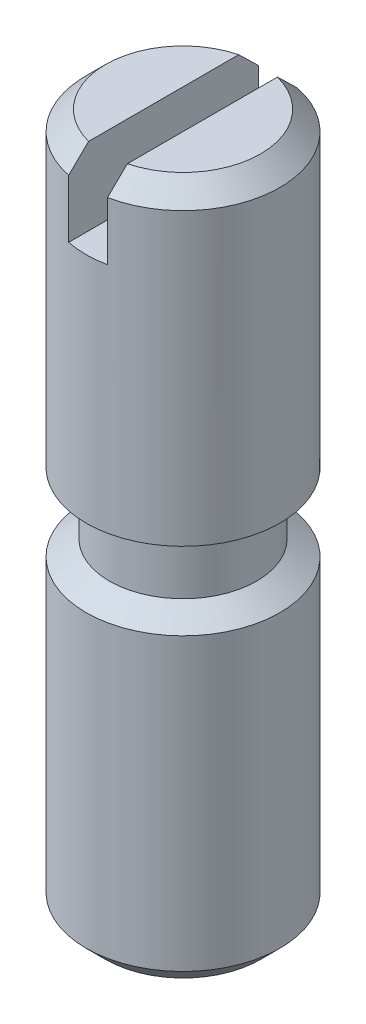
ISO-10303-21;
HEADER;
FILE_DESCRIPTION(('STEP AP214'),'2;1');
FILE_NAME('part.step','',(''),(''),'','','');
FILE_SCHEMA(('AUTOMOTIVE_DESIGN { 1 0 10303 214 1 1 1 1 }'));
ENDSEC;
DATA;
#1=APPLICATION_CONTEXT('core data for automotive mechanical design processes');
#2=APPLICATION_PROTOCOL_DEFINITION('international standard','automotive_design',2000,#1);
#3=PRODUCT_CONTEXT('',#1,'mechanical');
#4=PRODUCT('Part','Part','',(#3));
#5=PRODUCT_RELATED_PRODUCT_CATEGORY('part','',(#4));
#6=PRODUCT_DEFINITION_FORMATION('','',#4);
#7=PRODUCT_DEFINITION_CONTEXT('part definition',#1,'design');
#8=PRODUCT_DEFINITION('design','',#6,#7);
#9=PRODUCT_DEFINITION_SHAPE('','',#8);
#10=(LENGTH_UNIT() NAMED_UNIT(*) SI_UNIT(.MILLI.,.METRE.));
#11=(NAMED_UNIT(*) PLANE_ANGLE_UNIT() SI_UNIT($,.RADIAN.));
#12=(NAMED_UNIT(*) SI_UNIT($,.STERADIAN.) SOLID_ANGLE_UNIT());
#13=UNCERTAINTY_MEASURE_WITH_UNIT(LENGTH_MEASURE(1.E-05),#10,'distance_accuracy_value','');
#14=(GEOMETRIC_REPRESENTATION_CONTEXT(3) GLOBAL_UNCERTAINTY_ASSIGNED_CONTEXT((#13)) GLOBAL_UNIT_ASSIGNED_CONTEXT((#10,
#11,#12)) REPRESENTATION_CONTEXT('',''));
#15=CARTESIAN_POINT('',(0.,0.,0.));
#16=DIRECTION('',(0.,0.,1.));
#17=DIRECTION('',(1.,0.,0.));
#18=AXIS2_PLACEMENT_3D('',#15,#16,#17);
#19=CARTESIAN_POINT('',(0.,18.,0.));
#20=DIRECTION('',(0.,-1.,0.));
#21=DIRECTION('',(0.,0.,-1.));
#22=AXIS2_PLACEMENT_3D('',#19,#20,#21);
#23=CYLINDRICAL_SURFACE('',#22,2.5);
#24=DIRECTION('',(0.,-1.,0.));
#25=VECTOR('',#24,1.);
#26=CARTESIAN_POINT('',(0.5,18.,-2.44948974278318));
#27=LINE('',#26,#25);
#28=CARTESIAN_POINT('',(0.5,16.,-2.44948974278318));
#29=VERTEX_POINT('',#28);
#30=CARTESIAN_POINT('',(0.5,17.5,-2.44948974278318));
#31=VERTEX_POINT('',#30);
#32=EDGE_CURVE('E103',#29,#31,#27,.F.);
#33=ORIENTED_EDGE('',*,*,#32,.T.);
#34=CARTESIAN_POINT('',(0.,17.5,0.));
#35=DIRECTION('',(0.,1.,0.));
#36=DIRECTION('',(0.,0.,1.));
#37=AXIS2_PLACEMENT_3D('',#34,#35,#36);
#38=CIRCLE('',#37,2.5);
#39=CARTESIAN_POINT('',(0.500000000000001,17.5,2.44948974278318));
#40=VERTEX_POINT('',#39);
#41=EDGE_CURVE('E98',#31,#40,#38,.F.);
#42=ORIENTED_EDGE('',*,*,#41,.T.);
#43=DIRECTION('',(0.,-1.,0.));
#44=VECTOR('',#43,1.);
#45=CARTESIAN_POINT('',(0.500000000000001,18.,2.44948974278318));
#46=LINE('',#45,#44);
#47=CARTESIAN_POINT('',(0.500000000000001,16.,2.44948974278318));
#48=VERTEX_POINT('',#47);
#49=EDGE_CURVE('E91',#40,#48,#46,.T.);
#50=ORIENTED_EDGE('',*,*,#49,.T.);
#51=CARTESIAN_POINT('',(0.,16.,0.));
#52=DIRECTION('',(0.,1.,0.));
#53=DIRECTION('',(0.,0.,1.));
#54=AXIS2_PLACEMENT_3D('',#51,#52,#53);
#55=CIRCLE('',#54,2.5);
#56=CARTESIAN_POINT('',(-0.499999999999999,16.,2.44948974278318));
#57=VERTEX_POINT('',#56);
#58=EDGE_CURVE('E96',#57,#48,#55,.T.);
#59=ORIENTED_EDGE('',*,*,#58,.F.);
#60=DIRECTION('',(0.,-1.,0.));
#61=VECTOR('',#60,1.);
#62=CARTESIAN_POINT('',(-0.499999999999999,18.,2.44948974278318));
#63=LINE('',#62,#61);
#64=CARTESIAN_POINT('',(-0.499999999999999,17.5,2.44948974278318));
#65=VERTEX_POINT('',#64);
#66=EDGE_CURVE('E102',#57,#65,#63,.F.);
#67=ORIENTED_EDGE('',*,*,#66,.T.);
#68=CARTESIAN_POINT('',(0.,17.5,0.));
#69=DIRECTION('',(0.,1.,0.));
#70=DIRECTION('',(0.,0.,1.));
#71=AXIS2_PLACEMENT_3D('',#68,#69,#70);
#72=CIRCLE('',#71,2.5);
#73=CARTESIAN_POINT('',(-0.5,17.5,-2.44948974278318));
#74=VERTEX_POINT('',#73);
#75=EDGE_CURVE('E234',#65,#74,#72,.F.);
#76=ORIENTED_EDGE('',*,*,#75,.T.);
#77=DIRECTION('',(0.,-1.,0.));
#78=VECTOR('',#77,1.);
#79=CARTESIAN_POINT('',(-0.5,18.,-2.44948974278318));
#80=LINE('',#79,#78);
#81=CARTESIAN_POINT('',(-0.5,16.,-2.44948974278318));
#82=VERTEX_POINT('',#81);
#83=EDGE_CURVE('E126',#74,#82,#80,.T.);
#84=ORIENTED_EDGE('',*,*,#83,.T.);
#85=EDGE_CURVE('E114',#29,#82,#55,.T.);
#86=ORIENTED_EDGE('',*,*,#85,.F.);
#87=EDGE_LOOP('',(#33,#42,#50,#59,#67,#76,#84,#86));
#88=FACE_BOUND('',#87,.T.);
#89=CARTESIAN_POINT('',(0.,10.,0.));
#90=DIRECTION('',(0.,1.,0.));
#91=DIRECTION('',(0.,0.,1.));
#92=AXIS2_PLACEMENT_3D('',#89,#90,#91);
#93=CIRCLE('',#92,2.5);
#94=CARTESIAN_POINT('',(0.,10.,2.5));
#95=VERTEX_POINT('',#94);
#96=EDGE_CURVE('E121',#95,#95,#93,.T.);
#97=ORIENTED_EDGE('',*,*,#96,.T.);
#98=EDGE_LOOP('',(#97));
#99=FACE_BOUND('',#98,.T.);
#100=ADVANCED_FACE('F36',(#88,#99),#23,.T.);
#101=CARTESIAN_POINT('',(0.,18.,0.));
#102=DIRECTION('',(0.,1.,0.));
#103=DIRECTION('',(0.,0.,1.));
#104=AXIS2_PLACEMENT_3D('',#101,#102,#103);
#105=PLANE('',#104);
#106=DIRECTION('',(0.,0.,1.));
#107=VECTOR('',#106,1.);
#108=CARTESIAN_POINT('',(-0.5,18.,0.));
#109=LINE('',#108,#107);
#110=CARTESIAN_POINT('',(-0.5,18.,-1.9364916731037));
#111=VERTEX_POINT('',#110);
#112=CARTESIAN_POINT('',(-0.499999999999999,18.,1.9364916731037));
#113=VERTEX_POINT('',#112);
#114=EDGE_CURVE('E115',#111,#113,#109,.T.);
#115=ORIENTED_EDGE('',*,*,#114,.F.);
#116=CARTESIAN_POINT('',(0.,18.,0.));
#117=DIRECTION('',(0.,1.,0.));
#118=DIRECTION('',(0.,0.,1.));
#119=AXIS2_PLACEMENT_3D('',#116,#117,#118);
#120=CIRCLE('',#119,2.);
#121=EDGE_CURVE('E237',#111,#113,#120,.T.);
#122=ORIENTED_EDGE('',*,*,#121,.T.);
#123=EDGE_LOOP('',(#115,#122));
#124=FACE_BOUND('',#123,.T.);
#125=ADVANCED_FACE('F183',(#124),#105,.T.);
#126=DIRECTION('',(0.,0.,-1.));
#127=VECTOR('',#126,1.);
#128=CARTESIAN_POINT('',(0.5,18.,0.));
#129=LINE('',#128,#127);
#130=CARTESIAN_POINT('',(0.500000000000001,18.,1.9364916731037));
#131=VERTEX_POINT('',#130);
#132=CARTESIAN_POINT('',(0.5,18.,-1.9364916731037));
#133=VERTEX_POINT('',#132);
#134=EDGE_CURVE('E128',#131,#133,#129,.T.);
#135=ORIENTED_EDGE('',*,*,#134,.F.);
#136=CARTESIAN_POINT('',(0.,18.,0.));
#137=DIRECTION('',(0.,1.,0.));
#138=DIRECTION('',(0.,0.,1.));
#139=AXIS2_PLACEMENT_3D('',#136,#137,#138);
#140=CIRCLE('',#139,2.);
#141=EDGE_CURVE('E131',#131,#133,#140,.T.);
#142=ORIENTED_EDGE('',*,*,#141,.T.);
#143=EDGE_LOOP('',(#135,#142));
#144=FACE_BOUND('',#143,.T.);
#145=ADVANCED_FACE('F159',(#144),#105,.T.);
#146=CARTESIAN_POINT('',(-0.499999999999999,16.,4.94695527819999));
#147=DIRECTION('',(0.,1.,0.));
#148=DIRECTION('',(0.,0.,1.));
#149=AXIS2_PLACEMENT_3D('',#146,#147,#148);
#150=PLANE('',#149);
#151=ORIENTED_EDGE('',*,*,#85,.T.);
#152=DIRECTION('',(0.,0.,1.));
#153=VECTOR('',#152,1.);
#154=CARTESIAN_POINT('',(-0.5,16.,-3.80448227912211));
#155=LINE('',#154,#153);
#156=EDGE_CURVE('E113',#82,#57,#155,.T.);
#157=ORIENTED_EDGE('',*,*,#156,.T.);
#158=ORIENTED_EDGE('',*,*,#58,.T.);
#159=DIRECTION('',(0.,0.,-1.));
#160=VECTOR('',#159,1.);
#161=CARTESIAN_POINT('',(0.5,16.,-3.80448227912211));
#162=LINE('',#161,#160);
#163=EDGE_CURVE('E110',#48,#29,#162,.T.);
#164=ORIENTED_EDGE('',*,*,#163,.T.);
#165=EDGE_LOOP('',(#151,#157,#158,#164));
#166=FACE_BOUND('',#165,.T.);
#167=ADVANCED_FACE('F109',(#166),#150,.T.);
#168=CARTESIAN_POINT('',(-0.5,16.,-3.80448227912211));
#169=DIRECTION('',(-1.,0.,0.));
#170=DIRECTION('',(0.,0.,1.));
#171=AXIS2_PLACEMENT_3D('',#168,#169,#170);
#172=PLANE('',#171);
#173=ORIENTED_EDGE('',*,*,#114,.T.);
#174=CARTESIAN_POINT('',(-0.499999999999999,18.,1.9364916731037));
#175=CARTESIAN_POINT('',(-0.499999999999999,17.9584739891285,1.97937842021901));
#176=CARTESIAN_POINT('',(-0.499999999999999,17.9169046578955,2.02222317422963));
#177=CARTESIAN_POINT('',(-0.499999999999999,17.8336921234945,2.10784071321671));
#178=CARTESIAN_POINT('',(-0.499999999999999,17.7920489204858,2.1506134983479));
#179=CARTESIAN_POINT('',(-0.499999999999999,17.7087012598324,2.23609927318237));
#180=CARTESIAN_POINT('',(-0.499999999999999,17.6669968022281,2.27881226292497));
#181=CARTESIAN_POINT('',(-0.499999999999999,17.5835354615012,2.36418717471362));
#182=CARTESIAN_POINT('',(-0.499999999999999,17.5417785782661,2.40684909664984));
#183=CARTESIAN_POINT('',(-0.499999999999999,17.5,2.44948974278318));
#184=B_SPLINE_CURVE_WITH_KNOTS('',3,(#174,#175,#176,#177,#178,#179,#180,#181,#182,#183),
.UNSPECIFIED.,.F.,.F.,(4,2,2,2,4),(0.,0.179089685770155,0.358178986005779,0.537268168449539,
0.716357735365869),.UNSPECIFIED.);
#185=EDGE_CURVE('E44',#113,#65,#184,.T.);
#186=ORIENTED_EDGE('',*,*,#185,.T.);
#187=ORIENTED_EDGE('',*,*,#66,.F.);
#188=ORIENTED_EDGE('',*,*,#156,.F.);
#189=ORIENTED_EDGE('',*,*,#83,.F.);
#190=CARTESIAN_POINT('',(-0.5,17.5,-2.44948974278318));
#191=CARTESIAN_POINT('',(-0.5,17.5417785782661,-2.40684909664984));
#192=CARTESIAN_POINT('',(-0.5,17.5835354615012,-2.36418717471362));
#193=CARTESIAN_POINT('',(-0.5,17.6669968022281,-2.27881226292497));
#194=CARTESIAN_POINT('',(-0.5,17.7087012598324,-2.23609927318237));
#195=CARTESIAN_POINT('',(-0.5,17.7920489204858,-2.1506134983479));
#196=CARTESIAN_POINT('',(-0.5,17.8336921234945,-2.10784071321671));
#197=CARTESIAN_POINT('',(-0.5,17.9169046578955,-2.02222317422964));
#198=CARTESIAN_POINT('',(-0.5,17.9584739891285,-1.97937842021901));
#199=CARTESIAN_POINT('',(-0.5,18.,-1.93649167310371));
#200=B_SPLINE_CURVE_WITH_KNOTS('',3,(#190,#191,#192,#193,#194,#195,#196,#197,#198,#199),
.UNSPECIFIED.,.F.,.F.,(4,2,2,2,4),(0.,0.179089566916328,0.358178749360088,0.537268049595715,
0.716357735365869),.UNSPECIFIED.);
#201=EDGE_CURVE('E58',#74,#111,#200,.T.);
#202=ORIENTED_EDGE('',*,*,#201,.T.);
#203=EDGE_LOOP('',(#173,#186,#187,#188,#189,#202));
#204=FACE_BOUND('',#203,.T.);
#205=ADVANCED_FACE('F153',(#204),#172,.F.);
#206=CARTESIAN_POINT('',(0.5,16.,-3.80448227912211));
#207=DIRECTION('',(1.,0.,0.));
#208=DIRECTION('',(0.,0.,-1.));
#209=AXIS2_PLACEMENT_3D('',#206,#207,#208);
#210=PLANE('',#209);
#211=ORIENTED_EDGE('',*,*,#134,.T.);
#212=CARTESIAN_POINT('',(0.5,18.,-1.9364916731037));
#213=CARTESIAN_POINT('',(0.5,17.9584739891285,-1.97937842021901));
#214=CARTESIAN_POINT('',(0.5,17.9169046578955,-2.02222317422963));
#215=CARTESIAN_POINT('',(0.5,17.8336921234945,-2.10784071321671));
#216=CARTESIAN_POINT('',(0.5,17.7920489204858,-2.1506134983479));
#217=CARTESIAN_POINT('',(0.5,17.7087012598324,-2.23609927318237));
#218=CARTESIAN_POINT('',(0.5,17.6669968022281,-2.27881226292498));
#219=CARTESIAN_POINT('',(0.5,17.5835354615012,-2.36418717471362));
#220=CARTESIAN_POINT('',(0.5,17.5417785782661,-2.40684909664984));
#221=CARTESIAN_POINT('',(0.5,17.5,-2.44948974278318));
#222=B_SPLINE_CURVE_WITH_KNOTS('',3,(#212,#213,#214,#215,#216,#217,#218,#219,#220,#221),
.UNSPECIFIED.,.F.,.F.,(4,2,2,2,4),(0.,0.179089685770155,0.35817898600578,0.537268168449543,
0.71635773536587),.UNSPECIFIED.);
#223=EDGE_CURVE('E141',#133,#31,#222,.T.);
#224=ORIENTED_EDGE('',*,*,#223,.T.);
#225=ORIENTED_EDGE('',*,*,#32,.F.);
#226=ORIENTED_EDGE('',*,*,#163,.F.);
#227=ORIENTED_EDGE('',*,*,#49,.F.);
#228=CARTESIAN_POINT('',(0.500000000000001,17.5,2.44948974278318));
#229=CARTESIAN_POINT('',(0.500000000000001,17.5417785782661,2.40684909664984));
#230=CARTESIAN_POINT('',(0.500000000000001,17.5835354615012,2.36418717471362));
#231=CARTESIAN_POINT('',(0.500000000000001,17.6669968022281,2.27881226292497));
#232=CARTESIAN_POINT('',(0.500000000000001,17.7087012598324,2.23609927318237));
#233=CARTESIAN_POINT('',(0.500000000000001,17.7920489204858,2.1506134983479));
#234=CARTESIAN_POINT('',(0.500000000000001,17.8336921234945,2.10784071321671));
#235=CARTESIAN_POINT('',(0.500000000000001,17.9169046578955,2.02222317422963));
#236=CARTESIAN_POINT('',(0.500000000000001,17.9584739891285,1.97937842021901));
#237=CARTESIAN_POINT('',(0.500000000000001,18.,1.9364916731037));
#238=B_SPLINE_CURVE_WITH_KNOTS('',3,(#228,#229,#230,#231,#232,#233,#234,#235,#236,#237),
.UNSPECIFIED.,.F.,.F.,(4,2,2,2,4),(0.,0.179089566916331,0.35817874936009,0.537268049595715,
0.71635773536587),.UNSPECIFIED.);
#239=EDGE_CURVE('E134',#40,#131,#238,.T.);
#240=ORIENTED_EDGE('',*,*,#239,.T.);
#241=EDGE_LOOP('',(#211,#224,#225,#226,#227,#240));
#242=FACE_BOUND('',#241,.T.);
#243=ADVANCED_FACE('F118',(#242),#210,.F.);
#244=CARTESIAN_POINT('',(0.,18.,0.));
#245=DIRECTION('',(0.,-1.,0.));
#246=DIRECTION('',(0.,0.,-1.));
#247=AXIS2_PLACEMENT_3D('',#244,#245,#246);
#248=CONICAL_SURFACE('',#247,2.,0.785398163397448);
#249=ORIENTED_EDGE('',*,*,#239,.F.);
#250=ORIENTED_EDGE('',*,*,#41,.F.);
#251=ORIENTED_EDGE('',*,*,#223,.F.);
#252=ORIENTED_EDGE('',*,*,#141,.F.);
#253=EDGE_LOOP('',(#249,#250,#251,#252));
#254=FACE_BOUND('',#253,.T.);
#255=ADVANCED_FACE('F146',(#254),#248,.T.);
#256=CARTESIAN_POINT('',(0.,18.,0.));
#257=DIRECTION('',(0.,-1.,0.));
#258=DIRECTION('',(0.,0.,-1.));
#259=AXIS2_PLACEMENT_3D('',#256,#257,#258);
#260=CONICAL_SURFACE('',#259,2.,0.785398163397448);
#261=ORIENTED_EDGE('',*,*,#201,.F.);
#262=ORIENTED_EDGE('',*,*,#75,.F.);
#263=ORIENTED_EDGE('',*,*,#185,.F.);
#264=ORIENTED_EDGE('',*,*,#121,.F.);
#265=EDGE_LOOP('',(#261,#262,#263,#264));
#266=FACE_BOUND('',#265,.T.);
#267=ADVANCED_FACE('F170',(#266),#260,.T.);
#268=CARTESIAN_POINT('',(2.5,10.,0.));
#269=DIRECTION('',(0.,-1.,0.));
#270=DIRECTION('',(0.,0.,-1.));
#271=AXIS2_PLACEMENT_3D('',#268,#269,#270);
#272=PLANE('',#271);
#273=CARTESIAN_POINT('',(0.,10.,0.));
#274=DIRECTION('',(0.,1.,0.));
#275=DIRECTION('',(0.,0.,1.));
#276=AXIS2_PLACEMENT_3D('',#273,#274,#275);
#277=CIRCLE('',#276,1.9);
#278=CARTESIAN_POINT('',(0.,10.,1.9));
#279=VERTEX_POINT('',#278);
#280=EDGE_CURVE('E207',#279,#279,#277,.T.);
#281=ORIENTED_EDGE('',*,*,#280,.T.);
#282=EDGE_LOOP('',(#281));
#283=FACE_BOUND('',#282,.T.);
#284=ORIENTED_EDGE('',*,*,#96,.F.);
#285=EDGE_LOOP('',(#284));
#286=FACE_BOUND('',#285,.T.);
#287=ADVANCED_FACE('F173',(#283,#286),#272,.T.);
#288=CARTESIAN_POINT('',(0.,12.2324832688002,0.));
#289=DIRECTION('',(0.,1.,0.));
#290=DIRECTION('',(0.,0.,1.));
#291=AXIS2_PLACEMENT_3D('',#288,#289,#290);
#292=CYLINDRICAL_SURFACE('',#291,1.9);
#293=CARTESIAN_POINT('',(0.,8.40442113513973,0.));
#294=DIRECTION('',(0.,1.,0.));
#295=DIRECTION('',(0.,0.,1.));
#296=AXIS2_PLACEMENT_3D('',#293,#294,#295);
#297=CIRCLE('',#296,1.9);
#298=CARTESIAN_POINT('',(0.,8.40442113513973,1.9));
#299=VERTEX_POINT('',#298);
#300=EDGE_CURVE('E204',#299,#299,#297,.T.);
#301=ORIENTED_EDGE('',*,*,#300,.T.);
#302=EDGE_LOOP('',(#301));
#303=FACE_BOUND('',#302,.T.);
#304=ORIENTED_EDGE('',*,*,#280,.F.);
#305=EDGE_LOOP('',(#304));
#306=FACE_BOUND('',#305,.T.);
#307=ADVANCED_FACE('F179',(#303,#306),#292,.T.);
#308=CARTESIAN_POINT('',(0.,8.40442113513973,0.));
#309=DIRECTION('',(0.,-1.,0.));
#310=DIRECTION('',(0.,0.,-1.));
#311=AXIS2_PLACEMENT_3D('',#308,#309,#310);
#312=CONICAL_SURFACE('',#311,1.9,0.977709747378858);
#313=CARTESIAN_POINT('',(0.,8.,0.));
#314=DIRECTION('',(0.,1.,0.));
#315=DIRECTION('',(0.,0.,1.));
#316=AXIS2_PLACEMENT_3D('',#313,#314,#315);
#317=CIRCLE('',#316,2.5);
#318=CARTESIAN_POINT('',(0.,8.,2.5));
#319=VERTEX_POINT('',#318);
#320=EDGE_CURVE('E202',#319,#319,#317,.T.);
#321=ORIENTED_EDGE('',*,*,#320,.T.);
#322=EDGE_LOOP('',(#321));
#323=FACE_BOUND('',#322,.T.);
#324=ORIENTED_EDGE('',*,*,#300,.F.);
#325=EDGE_LOOP('',(#324));
#326=FACE_BOUND('',#325,.T.);
#327=ADVANCED_FACE('F217',(#323,#326),#312,.T.);
#328=CARTESIAN_POINT('',(0.,0.,0.));
#329=DIRECTION('',(0.,1.,0.));
#330=DIRECTION('',(0.,0.,1.));
#331=AXIS2_PLACEMENT_3D('',#328,#329,#330);
#332=PLANE('',#331);
#333=CARTESIAN_POINT('',(0.,0.,0.));
#334=DIRECTION('',(0.,1.,0.));
#335=DIRECTION('',(0.,0.,1.));
#336=AXIS2_PLACEMENT_3D('',#333,#334,#335);
#337=CIRCLE('',#336,1.99999999999999);
#338=CARTESIAN_POINT('',(0.,0.,1.99999999999999));
#339=VERTEX_POINT('',#338);
#340=EDGE_CURVE('E11',#339,#339,#337,.F.);
#341=ORIENTED_EDGE('',*,*,#340,.T.);
#342=EDGE_LOOP('',(#341));
#343=FACE_BOUND('',#342,.T.);
#344=ADVANCED_FACE('F194',(#343),#332,.F.);
#345=CARTESIAN_POINT('',(0.,0.500000000000004,0.));
#346=DIRECTION('',(0.,1.,0.));
#347=DIRECTION('',(0.,0.,1.));
#348=AXIS2_PLACEMENT_3D('',#345,#346,#347);
#349=CONICAL_SURFACE('',#348,2.5,0.785398163397451);
#350=ORIENTED_EDGE('',*,*,#340,.F.);
#351=EDGE_LOOP('',(#350));
#352=FACE_BOUND('',#351,.T.);
#353=CARTESIAN_POINT('',(0.,0.500000000000004,0.));
#354=DIRECTION('',(0.,1.,0.));
#355=DIRECTION('',(0.,0.,1.));
#356=AXIS2_PLACEMENT_3D('',#353,#354,#355);
#357=CIRCLE('',#356,2.5);
#358=CARTESIAN_POINT('',(0.,0.500000000000004,2.5));
#359=VERTEX_POINT('',#358);
#360=EDGE_CURVE('E199',#359,#359,#357,.T.);
#361=ORIENTED_EDGE('',*,*,#360,.F.);
#362=EDGE_LOOP('',(#361));
#363=FACE_BOUND('',#362,.T.);
#364=ADVANCED_FACE('F38',(#352,#363),#349,.T.);
#365=ORIENTED_EDGE('',*,*,#360,.T.);
#366=EDGE_LOOP('',(#365));
#367=FACE_BOUND('',#366,.T.);
#368=ORIENTED_EDGE('',*,*,#320,.F.);
#369=EDGE_LOOP('',(#368));
#370=FACE_BOUND('',#369,.T.);
#371=ADVANCED_FACE('F184',(#367,#370),#23,.T.);
#372=CLOSED_SHELL('',(#100,#125,#145,#167,#205,#243,#255,#267,#287,#307,#327,#344,#364,#371));
#373=MANIFOLD_SOLID_BREP('B2',#372);
#374=ADVANCED_BREP_SHAPE_REPRESENTATION('',(#18,#373),#14);
#375=SHAPE_DEFINITION_REPRESENTATION(#9,#374);
ENDSEC;
END-ISO-10303-21;
